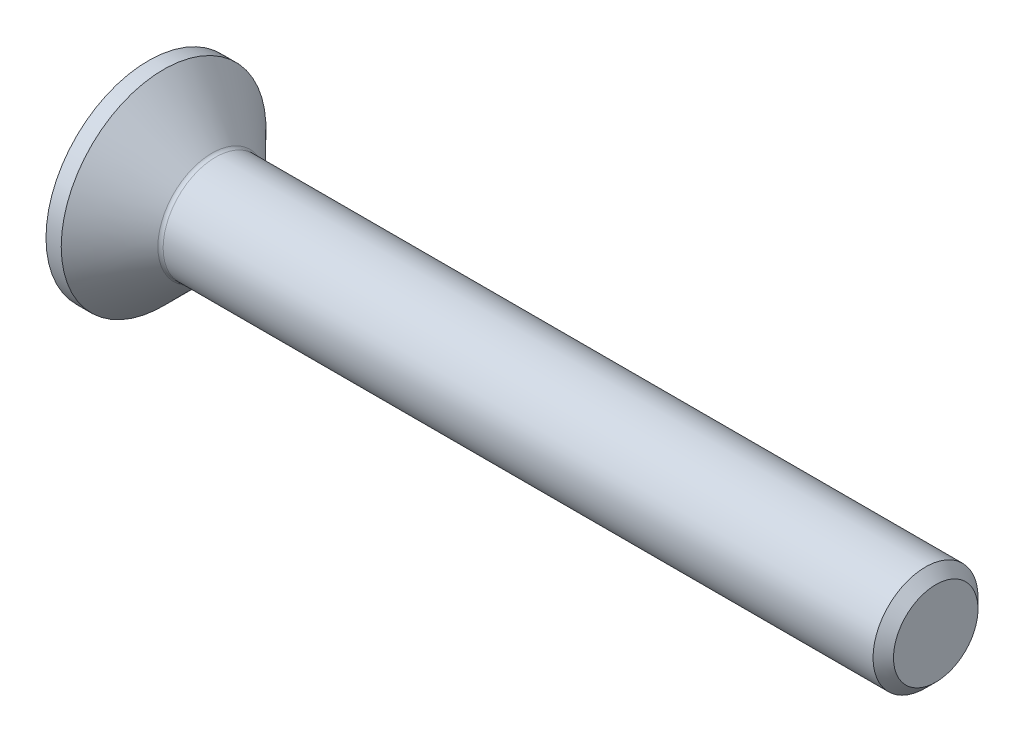
ISO-10303-21;
HEADER;
FILE_DESCRIPTION(('STEP AP214'),'2;1');
FILE_NAME('part.step','',(''),(''),'','','');
FILE_SCHEMA(('AUTOMOTIVE_DESIGN { 1 0 10303 214 1 1 1 1 }'));
ENDSEC;
DATA;
#1=APPLICATION_CONTEXT('core data for automotive mechanical design processes');
#2=APPLICATION_PROTOCOL_DEFINITION('international standard','automotive_design',2000,#1);
#3=PRODUCT_CONTEXT('',#1,'mechanical');
#4=PRODUCT('Part','Part','',(#3));
#5=PRODUCT_RELATED_PRODUCT_CATEGORY('part','',(#4));
#6=PRODUCT_DEFINITION_FORMATION('','',#4);
#7=PRODUCT_DEFINITION_CONTEXT('part definition',#1,'design');
#8=PRODUCT_DEFINITION('design','',#6,#7);
#9=PRODUCT_DEFINITION_SHAPE('','',#8);
#10=(LENGTH_UNIT() NAMED_UNIT(*) SI_UNIT(.MILLI.,.METRE.));
#11=(NAMED_UNIT(*) PLANE_ANGLE_UNIT() SI_UNIT($,.RADIAN.));
#12=(NAMED_UNIT(*) SI_UNIT($,.STERADIAN.) SOLID_ANGLE_UNIT());
#13=UNCERTAINTY_MEASURE_WITH_UNIT(LENGTH_MEASURE(1.E-05),#10,'distance_accuracy_value','');
#14=(GEOMETRIC_REPRESENTATION_CONTEXT(3) GLOBAL_UNCERTAINTY_ASSIGNED_CONTEXT((#13)) GLOBAL_UNIT_ASSIGNED_CONTEXT((#10,
#11,#12)) REPRESENTATION_CONTEXT('',''));
#15=CARTESIAN_POINT('',(0.,0.,0.));
#16=DIRECTION('',(0.,0.,1.));
#17=DIRECTION('',(1.,0.,0.));
#18=AXIS2_PLACEMENT_3D('',#15,#16,#17);
#19=CARTESIAN_POINT('',(0.,0.,0.));
#20=DIRECTION('',(-1.,0.,0.));
#21=DIRECTION('',(0.,0.,1.));
#22=AXIS2_PLACEMENT_3D('',#19,#20,#21);
#23=PLANE('',#22);
#24=CARTESIAN_POINT('',(0.,0.,0.));
#25=DIRECTION('',(-1.,0.,0.));
#26=DIRECTION('',(0.,0.,1.));
#27=AXIS2_PLACEMENT_3D('',#24,#25,#26);
#28=CIRCLE('',#27,3.9);
#29=CARTESIAN_POINT('',(0.,0.,3.9));
#30=VERTEX_POINT('',#29);
#31=EDGE_CURVE('E159',#30,#30,#28,.T.);
#32=ORIENTED_EDGE('',*,*,#31,.T.);
#33=EDGE_LOOP('',(#32));
#34=FACE_BOUND('',#33,.T.);
#35=DIRECTION('',(0.,-0.5,-0.866025403784438));
#36=VECTOR('',#35,1.);
#37=CARTESIAN_POINT('',(0.,-0.721687836487032,1.25));
#38=LINE('',#37,#36);
#39=CARTESIAN_POINT('',(0.,-0.721687836487032,1.25));
#40=VERTEX_POINT('',#39);
#41=CARTESIAN_POINT('',(0.,-1.44337567297407,0.));
#42=VERTEX_POINT('',#41);
#43=EDGE_CURVE('E121',#40,#42,#38,.T.);
#44=ORIENTED_EDGE('',*,*,#43,.T.);
#45=DIRECTION('',(0.,0.5,-0.866025403784438));
#46=VECTOR('',#45,1.);
#47=CARTESIAN_POINT('',(0.,-1.44337567297407,0.));
#48=LINE('',#47,#46);
#49=CARTESIAN_POINT('',(0.,-0.721687836487032,-1.25));
#50=VERTEX_POINT('',#49);
#51=EDGE_CURVE('E51',#42,#50,#48,.T.);
#52=ORIENTED_EDGE('',*,*,#51,.T.);
#53=DIRECTION('',(0.,1.,0.));
#54=VECTOR('',#53,1.);
#55=CARTESIAN_POINT('',(0.,-0.721687836487032,-1.25));
#56=LINE('',#55,#54);
#57=CARTESIAN_POINT('',(0.,0.721687836487032,-1.25));
#58=VERTEX_POINT('',#57);
#59=EDGE_CURVE('E136',#50,#58,#56,.T.);
#60=ORIENTED_EDGE('',*,*,#59,.T.);
#61=DIRECTION('',(0.,0.5,0.866025403784438));
#62=VECTOR('',#61,1.);
#63=CARTESIAN_POINT('',(0.,0.721687836487032,-1.25));
#64=LINE('',#63,#62);
#65=CARTESIAN_POINT('',(0.,1.44337567297406,0.));
#66=VERTEX_POINT('',#65);
#67=EDGE_CURVE('E272',#58,#66,#64,.T.);
#68=ORIENTED_EDGE('',*,*,#67,.T.);
#69=DIRECTION('',(0.,-0.5,0.866025403784438));
#70=VECTOR('',#69,1.);
#71=CARTESIAN_POINT('',(0.,1.44337567297406,0.));
#72=LINE('',#71,#70);
#73=CARTESIAN_POINT('',(0.,0.721687836487032,1.25));
#74=VERTEX_POINT('',#73);
#75=EDGE_CURVE('E275',#66,#74,#72,.T.);
#76=ORIENTED_EDGE('',*,*,#75,.T.);
#77=DIRECTION('',(0.,-1.,0.));
#78=VECTOR('',#77,1.);
#79=CARTESIAN_POINT('',(0.,0.721687836487032,1.25));
#80=LINE('',#79,#78);
#81=EDGE_CURVE('E278',#74,#40,#80,.T.);
#82=ORIENTED_EDGE('',*,*,#81,.T.);
#83=EDGE_LOOP('',(#44,#52,#60,#68,#76,#82));
#84=FACE_BOUND('',#83,.T.);
#85=ADVANCED_FACE('F36',(#34,#84),#23,.T.);
#86=CARTESIAN_POINT('',(0.,0.,0.));
#87=DIRECTION('',(-1.,0.,0.));
#88=DIRECTION('',(0.,0.,1.));
#89=AXIS2_PLACEMENT_3D('',#86,#87,#88);
#90=CYLINDRICAL_SURFACE('',#89,3.9);
#91=CARTESIAN_POINT('',(0.580000000000009,0.,0.));
#92=DIRECTION('',(-1.,0.,0.));
#93=DIRECTION('',(0.,0.,1.));
#94=AXIS2_PLACEMENT_3D('',#91,#92,#93);
#95=CIRCLE('',#94,3.9);
#96=CARTESIAN_POINT('',(0.580000000000009,0.,3.9));
#97=VERTEX_POINT('',#96);
#98=EDGE_CURVE('E156',#97,#97,#95,.T.);
#99=ORIENTED_EDGE('',*,*,#98,.T.);
#100=EDGE_LOOP('',(#99));
#101=FACE_BOUND('',#100,.T.);
#102=ORIENTED_EDGE('',*,*,#31,.F.);
#103=EDGE_LOOP('',(#102));
#104=FACE_BOUND('',#103,.T.);
#105=ADVANCED_FACE('F180',(#101,#104),#90,.T.);
#106=CARTESIAN_POINT('',(0.580000000000009,0.,0.));
#107=DIRECTION('',(-1.,0.,0.));
#108=DIRECTION('',(0.,0.,1.));
#109=AXIS2_PLACEMENT_3D('',#106,#107,#108);
#110=CONICAL_SURFACE('',#109,3.9,0.78539816339745);
#111=CARTESIAN_POINT('',(2.42142135623738,0.,0.));
#112=DIRECTION('',(-1.,0.,0.));
#113=DIRECTION('',(0.,0.,1.));
#114=AXIS2_PLACEMENT_3D('',#111,#112,#113);
#115=CIRCLE('',#114,2.05857864376262);
#116=CARTESIAN_POINT('',(2.42142135623738,0.,2.05857864376262));
#117=VERTEX_POINT('',#116);
#118=EDGE_CURVE('E44',#117,#117,#115,.T.);
#119=ORIENTED_EDGE('',*,*,#118,.T.);
#120=EDGE_LOOP('',(#119));
#121=FACE_BOUND('',#120,.T.);
#122=ORIENTED_EDGE('',*,*,#98,.F.);
#123=EDGE_LOOP('',(#122));
#124=FACE_BOUND('',#123,.T.);
#125=ADVANCED_FACE('F164',(#121,#124),#110,.T.);
#126=CARTESIAN_POINT('',(0.,0.,0.));
#127=DIRECTION('',(-1.,0.,0.));
#128=DIRECTION('',(0.,0.,1.));
#129=AXIS2_PLACEMENT_3D('',#126,#127,#128);
#130=CYLINDRICAL_SURFACE('',#129,1.99999999999993);
#131=CARTESIAN_POINT('',(2.56284271247469,0.,0.));
#132=DIRECTION('',(-1.,0.,0.));
#133=DIRECTION('',(0.,0.,1.));
#134=AXIS2_PLACEMENT_3D('',#131,#132,#133);
#135=CIRCLE('',#134,1.99999999999993);
#136=CARTESIAN_POINT('',(2.56284271247469,0.,1.99999999999993));
#137=VERTEX_POINT('',#136);
#138=EDGE_CURVE('E11',#137,#137,#135,.F.);
#139=ORIENTED_EDGE('',*,*,#138,.T.);
#140=EDGE_LOOP('',(#139));
#141=FACE_BOUND('',#140,.T.);
#142=CARTESIAN_POINT('',(29.6099999999999,0.,0.));
#143=DIRECTION('',(-1.,0.,0.));
#144=DIRECTION('',(0.,0.,1.));
#145=AXIS2_PLACEMENT_3D('',#142,#143,#144);
#146=CIRCLE('',#145,1.99999999999985);
#147=CARTESIAN_POINT('',(29.6099999999999,0.,1.99999999999985));
#148=VERTEX_POINT('',#147);
#149=EDGE_CURVE('E153',#148,#148,#146,.T.);
#150=ORIENTED_EDGE('',*,*,#149,.T.);
#151=EDGE_LOOP('',(#150));
#152=FACE_BOUND('',#151,.T.);
#153=ADVANCED_FACE('F191',(#141,#152),#130,.T.);
#154=CARTESIAN_POINT('',(30.,0.,0.));
#155=DIRECTION('',(-1.,0.,0.));
#156=DIRECTION('',(0.,0.,1.));
#157=AXIS2_PLACEMENT_3D('',#154,#155,#156);
#158=CONICAL_SURFACE('',#157,1.61,0.785398163397075);
#159=ORIENTED_EDGE('',*,*,#149,.F.);
#160=EDGE_LOOP('',(#159));
#161=FACE_BOUND('',#160,.T.);
#162=CARTESIAN_POINT('',(30.,0.,0.));
#163=DIRECTION('',(-1.,0.,0.));
#164=DIRECTION('',(0.,0.,1.));
#165=AXIS2_PLACEMENT_3D('',#162,#163,#164);
#166=CIRCLE('',#165,1.61);
#167=CARTESIAN_POINT('',(30.,0.,1.61));
#168=VERTEX_POINT('',#167);
#169=EDGE_CURVE('E149',#168,#168,#166,.T.);
#170=ORIENTED_EDGE('',*,*,#169,.T.);
#171=EDGE_LOOP('',(#170));
#172=FACE_BOUND('',#171,.T.);
#173=ADVANCED_FACE('F175',(#161,#172),#158,.T.);
#174=CARTESIAN_POINT('',(30.,1.61,0.));
#175=DIRECTION('',(1.,0.,0.));
#176=DIRECTION('',(0.,0.,-1.));
#177=AXIS2_PLACEMENT_3D('',#174,#175,#176);
#178=PLANE('',#177);
#179=ORIENTED_EDGE('',*,*,#169,.F.);
#180=EDGE_LOOP('',(#179));
#181=FACE_BOUND('',#180,.T.);
#182=ADVANCED_FACE('F168',(#181),#178,.T.);
#183=CARTESIAN_POINT('',(2.56284271247469,0.,0.));
#184=DIRECTION('',(-1.,0.,0.));
#185=DIRECTION('',(0.,0.,1.));
#186=AXIS2_PLACEMENT_3D('',#183,#184,#185);
#187=TOROIDAL_SURFACE('',#186,2.19999999999993,0.2);
#188=ORIENTED_EDGE('',*,*,#138,.F.);
#189=EDGE_LOOP('',(#188));
#190=FACE_BOUND('',#189,.T.);
#191=ORIENTED_EDGE('',*,*,#118,.F.);
#192=EDGE_LOOP('',(#191));
#193=FACE_BOUND('',#192,.T.);
#194=ADVANCED_FACE('F38',(#190,#193),#187,.F.);
#195=CARTESIAN_POINT('',(1.5,-1.44337567297407,0.));
#196=DIRECTION('',(0.,0.866025403784438,0.5));
#197=DIRECTION('',(0.,-0.5,0.866025403784439));
#198=AXIS2_PLACEMENT_3D('',#195,#196,#197);
#199=PLANE('',#198);
#200=ORIENTED_EDGE('',*,*,#51,.F.);
#201=DIRECTION('',(-1.,0.,0.));
#202=VECTOR('',#201,1.);
#203=CARTESIAN_POINT('',(1.5,-1.44337567297407,0.));
#204=LINE('',#203,#202);
#205=CARTESIAN_POINT('',(1.5,-1.44337567297407,0.));
#206=VERTEX_POINT('',#205);
#207=EDGE_CURVE('E269',#206,#42,#204,.T.);
#208=ORIENTED_EDGE('',*,*,#207,.F.);
#209=DIRECTION('',(0.,0.5,-0.866025403784438));
#210=VECTOR('',#209,1.);
#211=CARTESIAN_POINT('',(1.5,-1.44337567297407,0.));
#212=LINE('',#211,#210);
#213=CARTESIAN_POINT('',(1.5,-1.08253175473055,-0.625000000000001));
#214=VERTEX_POINT('',#213);
#215=EDGE_CURVE('E118',#206,#214,#212,.T.);
#216=ORIENTED_EDGE('',*,*,#215,.T.);
#217=CARTESIAN_POINT('',(1.5,-0.721687836487032,-1.25));
#218=VERTEX_POINT('',#217);
#219=EDGE_CURVE('E112',#214,#218,#212,.T.);
#220=ORIENTED_EDGE('',*,*,#219,.T.);
#221=DIRECTION('',(-1.,0.,0.));
#222=VECTOR('',#221,1.);
#223=CARTESIAN_POINT('',(1.5,-0.721687836487032,-1.25));
#224=LINE('',#223,#222);
#225=EDGE_CURVE('E116',#218,#50,#224,.T.);
#226=ORIENTED_EDGE('',*,*,#225,.T.);
#227=EDGE_LOOP('',(#200,#208,#216,#220,#226));
#228=FACE_BOUND('',#227,.T.);
#229=ADVANCED_FACE('F114',(#228),#199,.T.);
#230=CARTESIAN_POINT('',(1.5,-0.721687836487032,-1.25));
#231=DIRECTION('',(0.,0.,1.));
#232=DIRECTION('',(0.,-1.,0.));
#233=AXIS2_PLACEMENT_3D('',#230,#231,#232);
#234=PLANE('',#233);
#235=ORIENTED_EDGE('',*,*,#59,.F.);
#236=ORIENTED_EDGE('',*,*,#225,.F.);
#237=DIRECTION('',(0.,1.,0.));
#238=VECTOR('',#237,1.);
#239=CARTESIAN_POINT('',(1.5,-0.721687836487032,-1.25));
#240=LINE('',#239,#238);
#241=CARTESIAN_POINT('',(1.5,0.,-1.25));
#242=VERTEX_POINT('',#241);
#243=EDGE_CURVE('E124',#218,#242,#240,.T.);
#244=ORIENTED_EDGE('',*,*,#243,.T.);
#245=CARTESIAN_POINT('',(1.5,0.721687836487032,-1.25));
#246=VERTEX_POINT('',#245);
#247=EDGE_CURVE('E131',#242,#246,#240,.T.);
#248=ORIENTED_EDGE('',*,*,#247,.T.);
#249=DIRECTION('',(-1.,0.,0.));
#250=VECTOR('',#249,1.);
#251=CARTESIAN_POINT('',(1.5,0.721687836487032,-1.25));
#252=LINE('',#251,#250);
#253=EDGE_CURVE('E138',#246,#58,#252,.T.);
#254=ORIENTED_EDGE('',*,*,#253,.T.);
#255=EDGE_LOOP('',(#235,#236,#244,#248,#254));
#256=FACE_BOUND('',#255,.T.);
#257=ADVANCED_FACE('F133',(#256),#234,.T.);
#258=CARTESIAN_POINT('',(1.5,0.721687836487032,-1.25));
#259=DIRECTION('',(0.,-0.866025403784439,0.5));
#260=DIRECTION('',(0.,-0.5,-0.866025403784439));
#261=AXIS2_PLACEMENT_3D('',#258,#259,#260);
#262=PLANE('',#261);
#263=ORIENTED_EDGE('',*,*,#67,.F.);
#264=ORIENTED_EDGE('',*,*,#253,.F.);
#265=DIRECTION('',(0.,0.5,0.866025403784438));
#266=VECTOR('',#265,1.);
#267=CARTESIAN_POINT('',(1.5,0.721687836487032,-1.25));
#268=LINE('',#267,#266);
#269=CARTESIAN_POINT('',(1.5,1.08253175473055,-0.625));
#270=VERTEX_POINT('',#269);
#271=EDGE_CURVE('E261',#246,#270,#268,.T.);
#272=ORIENTED_EDGE('',*,*,#271,.T.);
#273=CARTESIAN_POINT('',(1.5,1.44337567297406,0.));
#274=VERTEX_POINT('',#273);
#275=EDGE_CURVE('E130',#270,#274,#268,.T.);
#276=ORIENTED_EDGE('',*,*,#275,.T.);
#277=DIRECTION('',(-1.,0.,0.));
#278=VECTOR('',#277,1.);
#279=CARTESIAN_POINT('',(1.5,1.44337567297406,0.));
#280=LINE('',#279,#278);
#281=EDGE_CURVE('E144',#274,#66,#280,.T.);
#282=ORIENTED_EDGE('',*,*,#281,.T.);
#283=EDGE_LOOP('',(#263,#264,#272,#276,#282));
#284=FACE_BOUND('',#283,.T.);
#285=ADVANCED_FACE('F205',(#284),#262,.T.);
#286=CARTESIAN_POINT('',(1.5,1.44337567297406,0.));
#287=DIRECTION('',(0.,-0.866025403784439,-0.5));
#288=DIRECTION('',(0.,0.5,-0.866025403784439));
#289=AXIS2_PLACEMENT_3D('',#286,#287,#288);
#290=PLANE('',#289);
#291=ORIENTED_EDGE('',*,*,#75,.F.);
#292=ORIENTED_EDGE('',*,*,#281,.F.);
#293=DIRECTION('',(0.,-0.5,0.866025403784438));
#294=VECTOR('',#293,1.);
#295=CARTESIAN_POINT('',(1.5,1.44337567297406,0.));
#296=LINE('',#295,#294);
#297=CARTESIAN_POINT('',(1.5,1.08253175473055,0.625));
#298=VERTEX_POINT('',#297);
#299=EDGE_CURVE('E59',#274,#298,#296,.T.);
#300=ORIENTED_EDGE('',*,*,#299,.T.);
#301=CARTESIAN_POINT('',(1.5,0.721687836487032,1.25));
#302=VERTEX_POINT('',#301);
#303=EDGE_CURVE('E240',#298,#302,#296,.T.);
#304=ORIENTED_EDGE('',*,*,#303,.T.);
#305=DIRECTION('',(-1.,0.,0.));
#306=VECTOR('',#305,1.);
#307=CARTESIAN_POINT('',(1.5,0.721687836487032,1.25));
#308=LINE('',#307,#306);
#309=EDGE_CURVE('E254',#302,#74,#308,.T.);
#310=ORIENTED_EDGE('',*,*,#309,.T.);
#311=EDGE_LOOP('',(#291,#292,#300,#304,#310));
#312=FACE_BOUND('',#311,.T.);
#313=ADVANCED_FACE('F208',(#312),#290,.T.);
#314=CARTESIAN_POINT('',(1.5,0.721687836487032,1.25));
#315=DIRECTION('',(0.,0.,-1.));
#316=DIRECTION('',(0.,1.,0.));
#317=AXIS2_PLACEMENT_3D('',#314,#315,#316);
#318=PLANE('',#317);
#319=ORIENTED_EDGE('',*,*,#81,.F.);
#320=ORIENTED_EDGE('',*,*,#309,.F.);
#321=DIRECTION('',(0.,-1.,0.));
#322=VECTOR('',#321,1.);
#323=CARTESIAN_POINT('',(1.5,0.721687836487032,1.25));
#324=LINE('',#323,#322);
#325=CARTESIAN_POINT('',(1.5,0.,1.25));
#326=VERTEX_POINT('',#325);
#327=EDGE_CURVE('E239',#302,#326,#324,.T.);
#328=ORIENTED_EDGE('',*,*,#327,.T.);
#329=CARTESIAN_POINT('',(1.5,-0.721687836487032,1.25));
#330=VERTEX_POINT('',#329);
#331=EDGE_CURVE('E245',#326,#330,#324,.T.);
#332=ORIENTED_EDGE('',*,*,#331,.T.);
#333=DIRECTION('',(-1.,0.,0.));
#334=VECTOR('',#333,1.);
#335=CARTESIAN_POINT('',(1.5,-0.721687836487032,1.25));
#336=LINE('',#335,#334);
#337=EDGE_CURVE('E284',#330,#40,#336,.T.);
#338=ORIENTED_EDGE('',*,*,#337,.T.);
#339=EDGE_LOOP('',(#319,#320,#328,#332,#338));
#340=FACE_BOUND('',#339,.T.);
#341=ADVANCED_FACE('F212',(#340),#318,.T.);
#342=CARTESIAN_POINT('',(1.5,-0.721687836487032,1.25));
#343=DIRECTION('',(0.,0.866025403784438,-0.5));
#344=DIRECTION('',(0.,0.5,0.866025403784439));
#345=AXIS2_PLACEMENT_3D('',#342,#343,#344);
#346=PLANE('',#345);
#347=ORIENTED_EDGE('',*,*,#43,.F.);
#348=ORIENTED_EDGE('',*,*,#337,.F.);
#349=DIRECTION('',(0.,-0.5,-0.866025403784438));
#350=VECTOR('',#349,1.);
#351=CARTESIAN_POINT('',(1.5,-0.721687836487032,1.25));
#352=LINE('',#351,#350);
#353=CARTESIAN_POINT('',(1.5,-1.08253175473055,0.625000000000001));
#354=VERTEX_POINT('',#353);
#355=EDGE_CURVE('E248',#330,#354,#352,.T.);
#356=ORIENTED_EDGE('',*,*,#355,.T.);
#357=EDGE_CURVE('E255',#354,#206,#352,.T.);
#358=ORIENTED_EDGE('',*,*,#357,.T.);
#359=ORIENTED_EDGE('',*,*,#207,.T.);
#360=EDGE_LOOP('',(#347,#348,#356,#358,#359));
#361=FACE_BOUND('',#360,.T.);
#362=ADVANCED_FACE('F215',(#361),#346,.T.);
#363=CARTESIAN_POINT('',(1.5,-1.44337567297407,0.));
#364=DIRECTION('',(-1.,0.,0.));
#365=DIRECTION('',(0.,0.,1.));
#366=AXIS2_PLACEMENT_3D('',#363,#364,#365);
#367=PLANE('',#366);
#368=CARTESIAN_POINT('',(1.5,0.,0.));
#369=DIRECTION('',(-1.,0.,0.));
#370=DIRECTION('',(0.,0.,1.));
#371=AXIS2_PLACEMENT_3D('',#368,#369,#370);
#372=CIRCLE('',#371,1.25);
#373=EDGE_CURVE('E137',#354,#326,#372,.T.);
#374=ORIENTED_EDGE('',*,*,#373,.F.);
#375=ORIENTED_EDGE('',*,*,#355,.F.);
#376=ORIENTED_EDGE('',*,*,#331,.F.);
#377=EDGE_LOOP('',(#374,#375,#376));
#378=FACE_BOUND('',#377,.T.);
#379=ADVANCED_FACE('F219',(#378),#367,.T.);
#380=EDGE_CURVE('E141',#214,#354,#372,.T.);
#381=ORIENTED_EDGE('',*,*,#380,.F.);
#382=ORIENTED_EDGE('',*,*,#215,.F.);
#383=ORIENTED_EDGE('',*,*,#357,.F.);
#384=EDGE_LOOP('',(#381,#382,#383));
#385=FACE_BOUND('',#384,.T.);
#386=ADVANCED_FACE('F222',(#385),#367,.T.);
#387=EDGE_CURVE('E126',#242,#214,#372,.T.);
#388=ORIENTED_EDGE('',*,*,#387,.F.);
#389=ORIENTED_EDGE('',*,*,#243,.F.);
#390=ORIENTED_EDGE('',*,*,#219,.F.);
#391=EDGE_LOOP('',(#388,#389,#390));
#392=FACE_BOUND('',#391,.T.);
#393=ADVANCED_FACE('F125',(#392),#367,.T.);
#394=EDGE_CURVE('E257',#270,#242,#372,.T.);
#395=ORIENTED_EDGE('',*,*,#394,.F.);
#396=ORIENTED_EDGE('',*,*,#271,.F.);
#397=ORIENTED_EDGE('',*,*,#247,.F.);
#398=EDGE_LOOP('',(#395,#396,#397));
#399=FACE_BOUND('',#398,.T.);
#400=ADVANCED_FACE('F234',(#399),#367,.T.);
#401=EDGE_CURVE('E150',#298,#270,#372,.T.);
#402=ORIENTED_EDGE('',*,*,#401,.F.);
#403=ORIENTED_EDGE('',*,*,#299,.F.);
#404=ORIENTED_EDGE('',*,*,#275,.F.);
#405=EDGE_LOOP('',(#402,#403,#404));
#406=FACE_BOUND('',#405,.T.);
#407=ADVANCED_FACE('F229',(#406),#367,.T.);
#408=EDGE_CURVE('E143',#326,#298,#372,.T.);
#409=ORIENTED_EDGE('',*,*,#408,.F.);
#410=ORIENTED_EDGE('',*,*,#327,.F.);
#411=ORIENTED_EDGE('',*,*,#303,.F.);
#412=EDGE_LOOP('',(#409,#410,#411));
#413=FACE_BOUND('',#412,.T.);
#414=ADVANCED_FACE('F200',(#413),#367,.T.);
#415=CARTESIAN_POINT('',(1.5,0.,0.));
#416=DIRECTION('',(-1.,0.,0.));
#417=DIRECTION('',(0.,0.,1.));
#418=AXIS2_PLACEMENT_3D('',#415,#416,#417);
#419=CONICAL_SURFACE('',#418,1.25,1.04719755119659);
#420=CARTESIAN_POINT('',(2.22168783648704,0.,0.));
#421=VERTEX_POINT('',#420);
#422=VERTEX_LOOP('',#421);
#423=FACE_BOUND('',#422,.T.);
#424=ORIENTED_EDGE('',*,*,#408,.T.);
#425=ORIENTED_EDGE('',*,*,#401,.T.);
#426=ORIENTED_EDGE('',*,*,#394,.T.);
#427=ORIENTED_EDGE('',*,*,#387,.T.);
#428=ORIENTED_EDGE('',*,*,#380,.T.);
#429=ORIENTED_EDGE('',*,*,#373,.T.);
#430=EDGE_LOOP('',(#424,#425,#426,#427,#428,#429));
#431=FACE_BOUND('',#430,.T.);
#432=ADVANCED_FACE('F198',(#423,#431),#419,.F.);
#433=CLOSED_SHELL('',(#85,#105,#125,#153,#173,#182,#194,#229,#257,#285,#313,#341,#362,#379,#386,
#393,#400,#407,#414,#432));
#434=MANIFOLD_SOLID_BREP('B2',#433);
#435=ADVANCED_BREP_SHAPE_REPRESENTATION('',(#18,#434),#14);
#436=SHAPE_DEFINITION_REPRESENTATION(#9,#435);
ENDSEC;
END-ISO-10303-21;
